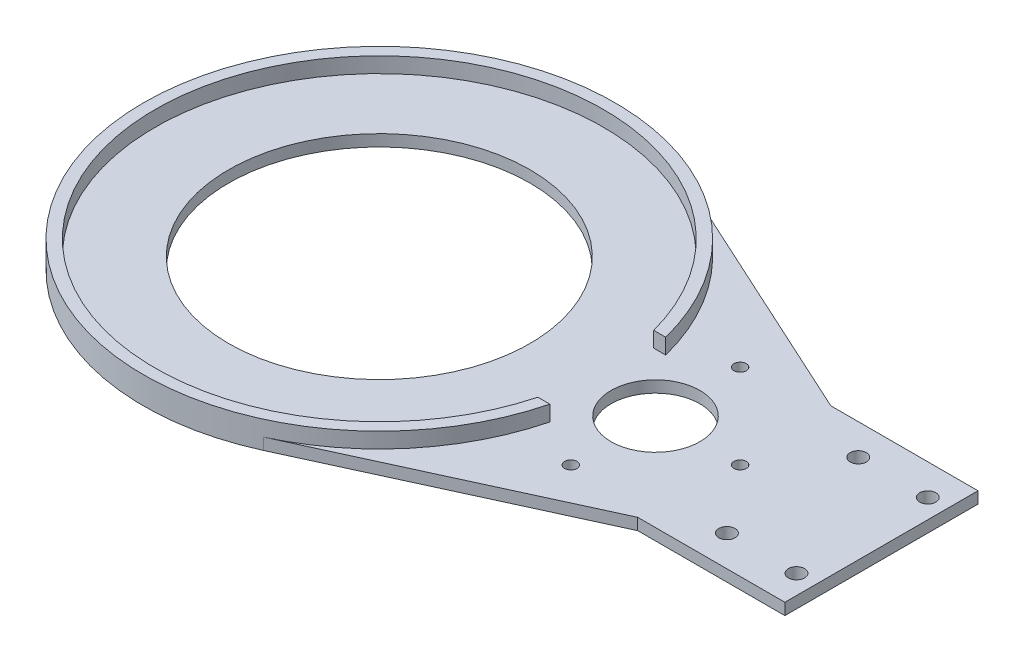
ISO-10303-21;
HEADER;
FILE_DESCRIPTION(('STEP AP214'),'2;1');
FILE_NAME('part.step','',(''),(''),'','','');
FILE_SCHEMA(('AUTOMOTIVE_DESIGN { 1 0 10303 214 1 1 1 1 }'));
ENDSEC;
DATA;
#1=APPLICATION_CONTEXT('core data for automotive mechanical design processes');
#2=APPLICATION_PROTOCOL_DEFINITION('international standard','automotive_design',2000,#1);
#3=PRODUCT_CONTEXT('',#1,'mechanical');
#4=PRODUCT('Part','Part','',(#3));
#5=PRODUCT_RELATED_PRODUCT_CATEGORY('part','',(#4));
#6=PRODUCT_DEFINITION_FORMATION('','',#4);
#7=PRODUCT_DEFINITION_CONTEXT('part definition',#1,'design');
#8=PRODUCT_DEFINITION('design','',#6,#7);
#9=PRODUCT_DEFINITION_SHAPE('','',#8);
#10=(LENGTH_UNIT() NAMED_UNIT(*) SI_UNIT(.MILLI.,.METRE.));
#11=(NAMED_UNIT(*) PLANE_ANGLE_UNIT() SI_UNIT($,.RADIAN.));
#12=(NAMED_UNIT(*) SI_UNIT($,.STERADIAN.) SOLID_ANGLE_UNIT());
#13=UNCERTAINTY_MEASURE_WITH_UNIT(LENGTH_MEASURE(1.E-05),#10,'distance_accuracy_value','');
#14=(GEOMETRIC_REPRESENTATION_CONTEXT(3) GLOBAL_UNCERTAINTY_ASSIGNED_CONTEXT((#13)) GLOBAL_UNIT_ASSIGNED_CONTEXT((#10,
#11,#12)) REPRESENTATION_CONTEXT('',''));
#15=CARTESIAN_POINT('',(0.,0.,0.));
#16=DIRECTION('',(0.,0.,1.));
#17=DIRECTION('',(1.,0.,0.));
#18=AXIS2_PLACEMENT_3D('',#15,#16,#17);
#19=CARTESIAN_POINT('',(91.9018888050589,3.,-25.));
#20=DIRECTION('',(0.,0.,1.));
#21=DIRECTION('',(1.,0.,0.));
#22=AXIS2_PLACEMENT_3D('',#19,#20,#21);
#23=PLANE('',#22);
#24=DIRECTION('',(-1.,0.,0.));
#25=VECTOR('',#24,1.);
#26=CARTESIAN_POINT('',(91.9018888050589,0.,-25.));
#27=LINE('',#26,#25);
#28=CARTESIAN_POINT('',(130.,0.,-25.));
#29=VERTEX_POINT('',#28);
#30=CARTESIAN_POINT('',(91.9018888050589,0.,-25.));
#31=VERTEX_POINT('',#30);
#32=EDGE_CURVE('E143',#29,#31,#27,.T.);
#33=ORIENTED_EDGE('',*,*,#32,.T.);
#34=DIRECTION('',(0.,-1.,0.));
#35=VECTOR('',#34,1.);
#36=CARTESIAN_POINT('',(91.9018888050589,3.,-25.));
#37=LINE('',#36,#35);
#38=CARTESIAN_POINT('',(91.9018888050589,3.,-25.));
#39=VERTEX_POINT('',#38);
#40=EDGE_CURVE('E172',#39,#31,#37,.T.);
#41=ORIENTED_EDGE('',*,*,#40,.F.);
#42=DIRECTION('',(-1.,0.,0.));
#43=VECTOR('',#42,1.);
#44=CARTESIAN_POINT('',(91.9018888050589,3.,-25.));
#45=LINE('',#44,#43);
#46=CARTESIAN_POINT('',(130.,3.,-25.));
#47=VERTEX_POINT('',#46);
#48=EDGE_CURVE('E161',#47,#39,#45,.T.);
#49=ORIENTED_EDGE('',*,*,#48,.F.);
#50=DIRECTION('',(0.,-1.,0.));
#51=VECTOR('',#50,1.);
#52=CARTESIAN_POINT('',(130.,3.,-25.));
#53=LINE('',#52,#51);
#54=EDGE_CURVE('E139',#47,#29,#53,.T.);
#55=ORIENTED_EDGE('',*,*,#54,.T.);
#56=EDGE_LOOP('',(#33,#41,#49,#55));
#57=FACE_BOUND('',#56,.T.);
#58=ADVANCED_FACE('F41',(#57),#23,.F.);
#59=CARTESIAN_POINT('',(91.9018888050589,3.,-25.));
#60=DIRECTION('',(-0.416742034836808,0.,0.909024794161345));
#61=DIRECTION('',(0.909024794161346,0.,0.416742034836809));
#62=AXIS2_PLACEMENT_3D('',#59,#60,#61);
#63=PLANE('',#62);
#64=DIRECTION('',(-0.909024794161346,0.,-0.416742034836809));
#65=VECTOR('',#64,1.);
#66=CARTESIAN_POINT('',(91.9018888050589,0.,-25.));
#67=LINE('',#66,#65);
#68=CARTESIAN_POINT('',(25.4316826759162,0.,-55.4732380636961));
#69=VERTEX_POINT('',#68);
#70=EDGE_CURVE('E147',#31,#69,#67,.T.);
#71=ORIENTED_EDGE('',*,*,#70,.T.);
#72=DIRECTION('',(0.,-1.,0.));
#73=VECTOR('',#72,1.);
#74=CARTESIAN_POINT('',(25.4316826759162,3.,-55.4732380636961));
#75=LINE('',#74,#73);
#76=CARTESIAN_POINT('',(25.4316826759162,3.,-55.4732380636961));
#77=VERTEX_POINT('',#76);
#78=EDGE_CURVE('E168',#77,#69,#75,.T.);
#79=ORIENTED_EDGE('',*,*,#78,.F.);
#80=DIRECTION('',(-0.909024794161346,0.,-0.416742034836809));
#81=VECTOR('',#80,1.);
#82=CARTESIAN_POINT('',(91.9018888050589,3.,-25.));
#83=LINE('',#82,#81);
#84=EDGE_CURVE('E101',#39,#77,#83,.T.);
#85=ORIENTED_EDGE('',*,*,#84,.F.);
#86=ORIENTED_EDGE('',*,*,#40,.T.);
#87=EDGE_LOOP('',(#71,#79,#85,#86));
#88=FACE_BOUND('',#87,.T.);
#89=ADVANCED_FACE('F313',(#88),#63,.F.);
#90=CARTESIAN_POINT('',(0.,3.,0.));
#91=DIRECTION('',(0.,-1.,0.));
#92=DIRECTION('',(0.,0.,-1.));
#93=AXIS2_PLACEMENT_3D('',#90,#91,#92);
#94=CYLINDRICAL_SURFACE('',#93,61.025);
#95=CARTESIAN_POINT('',(0.,7.,0.));
#96=DIRECTION('',(0.,1.,0.));
#97=DIRECTION('',(0.,0.,1.));
#98=AXIS2_PLACEMENT_3D('',#95,#96,#97);
#99=CIRCLE('',#98,61.025);
#100=CARTESIAN_POINT('',(59.1527736036105,7.,-15.));
#101=VERTEX_POINT('',#100);
#102=CARTESIAN_POINT('',(59.1527736036105,7.,15.));
#103=VERTEX_POINT('',#102);
#104=EDGE_CURVE('E232',#101,#103,#99,.T.);
#105=ORIENTED_EDGE('',*,*,#104,.F.);
#106=DIRECTION('',(0.,-1.,0.));
#107=VECTOR('',#106,1.);
#108=CARTESIAN_POINT('',(59.1527736036105,3.,-15.));
#109=LINE('',#108,#107);
#110=CARTESIAN_POINT('',(59.1527736036105,3.00000000000001,-15.));
#111=VERTEX_POINT('',#110);
#112=EDGE_CURVE('E188',#101,#111,#109,.T.);
#113=ORIENTED_EDGE('',*,*,#112,.T.);
#114=CARTESIAN_POINT('',(0.,3.,0.));
#115=DIRECTION('',(0.,1.,0.));
#116=DIRECTION('',(0.,0.,1.));
#117=AXIS2_PLACEMENT_3D('',#114,#115,#116);
#118=CIRCLE('',#117,61.025);
#119=EDGE_CURVE('E174',#111,#77,#118,.T.);
#120=ORIENTED_EDGE('',*,*,#119,.T.);
#121=ORIENTED_EDGE('',*,*,#78,.T.);
#122=CARTESIAN_POINT('',(0.,0.,0.));
#123=DIRECTION('',(0.,1.,0.));
#124=DIRECTION('',(0.,0.,1.));
#125=AXIS2_PLACEMENT_3D('',#122,#123,#124);
#126=CIRCLE('',#125,61.025);
#127=CARTESIAN_POINT('',(25.4316826759162,0.,55.4732380636961));
#128=VERTEX_POINT('',#127);
#129=EDGE_CURVE('E151',#69,#128,#126,.T.);
#130=ORIENTED_EDGE('',*,*,#129,.T.);
#131=DIRECTION('',(0.,-1.,0.));
#132=VECTOR('',#131,1.);
#133=CARTESIAN_POINT('',(25.4316826759162,3.,55.4732380636961));
#134=LINE('',#133,#132);
#135=CARTESIAN_POINT('',(25.4316826759162,3.,55.4732380636961));
#136=VERTEX_POINT('',#135);
#137=EDGE_CURVE('E132',#136,#128,#134,.T.);
#138=ORIENTED_EDGE('',*,*,#137,.F.);
#139=CARTESIAN_POINT('',(59.1527736036105,3.00000000000001,15.));
#140=VERTEX_POINT('',#139);
#141=EDGE_CURVE('E118',#136,#140,#118,.T.);
#142=ORIENTED_EDGE('',*,*,#141,.T.);
#143=DIRECTION('',(0.,-1.,0.));
#144=VECTOR('',#143,1.);
#145=CARTESIAN_POINT('',(59.1527736036105,3.,15.));
#146=LINE('',#145,#144);
#147=EDGE_CURVE('E200',#140,#103,#146,.F.);
#148=ORIENTED_EDGE('',*,*,#147,.T.);
#149=EDGE_LOOP('',(#105,#113,#120,#121,#130,#138,#142,#148));
#150=FACE_BOUND('',#149,.T.);
#151=ADVANCED_FACE('F315',(#150),#94,.T.);
#152=CARTESIAN_POINT('',(91.9018888050589,3.,25.));
#153=DIRECTION('',(-0.416742034836808,0.,-0.909024794161345));
#154=DIRECTION('',(-0.909024794161346,0.,0.416742034836809));
#155=AXIS2_PLACEMENT_3D('',#152,#153,#154);
#156=PLANE('',#155);
#157=DIRECTION('',(0.909024794161346,0.,-0.416742034836809));
#158=VECTOR('',#157,1.);
#159=CARTESIAN_POINT('',(91.9018888050589,0.,25.));
#160=LINE('',#159,#158);
#161=CARTESIAN_POINT('',(91.9018888050589,0.,25.));
#162=VERTEX_POINT('',#161);
#163=EDGE_CURVE('E128',#128,#162,#160,.T.);
#164=ORIENTED_EDGE('',*,*,#163,.T.);
#165=DIRECTION('',(0.,-1.,0.));
#166=VECTOR('',#165,1.);
#167=CARTESIAN_POINT('',(91.9018888050589,3.,25.));
#168=LINE('',#167,#166);
#169=CARTESIAN_POINT('',(91.9018888050589,3.,25.));
#170=VERTEX_POINT('',#169);
#171=EDGE_CURVE('E125',#170,#162,#168,.T.);
#172=ORIENTED_EDGE('',*,*,#171,.F.);
#173=DIRECTION('',(0.909024794161346,0.,-0.416742034836809));
#174=VECTOR('',#173,1.);
#175=CARTESIAN_POINT('',(91.9018888050589,3.,25.));
#176=LINE('',#175,#174);
#177=EDGE_CURVE('E109',#136,#170,#176,.T.);
#178=ORIENTED_EDGE('',*,*,#177,.F.);
#179=ORIENTED_EDGE('',*,*,#137,.T.);
#180=EDGE_LOOP('',(#164,#172,#178,#179));
#181=FACE_BOUND('',#180,.T.);
#182=ADVANCED_FACE('F126',(#181),#156,.F.);
#183=CARTESIAN_POINT('',(91.9018888050589,3.,25.));
#184=DIRECTION('',(0.,0.,-1.));
#185=DIRECTION('',(-1.,0.,0.));
#186=AXIS2_PLACEMENT_3D('',#183,#184,#185);
#187=PLANE('',#186);
#188=DIRECTION('',(1.,0.,0.));
#189=VECTOR('',#188,1.);
#190=CARTESIAN_POINT('',(91.9018888050589,0.,25.));
#191=LINE('',#190,#189);
#192=CARTESIAN_POINT('',(130.,0.,25.));
#193=VERTEX_POINT('',#192);
#194=EDGE_CURVE('E156',#162,#193,#191,.T.);
#195=ORIENTED_EDGE('',*,*,#194,.T.);
#196=DIRECTION('',(0.,-1.,0.));
#197=VECTOR('',#196,1.);
#198=CARTESIAN_POINT('',(130.,3.,25.));
#199=LINE('',#198,#197);
#200=CARTESIAN_POINT('',(130.,3.,25.));
#201=VERTEX_POINT('',#200);
#202=EDGE_CURVE('E133',#201,#193,#199,.T.);
#203=ORIENTED_EDGE('',*,*,#202,.F.);
#204=DIRECTION('',(1.,0.,0.));
#205=VECTOR('',#204,1.);
#206=CARTESIAN_POINT('',(91.9018888050589,3.,25.));
#207=LINE('',#206,#205);
#208=EDGE_CURVE('E115',#170,#201,#207,.T.);
#209=ORIENTED_EDGE('',*,*,#208,.F.);
#210=ORIENTED_EDGE('',*,*,#171,.T.);
#211=EDGE_LOOP('',(#195,#203,#209,#210));
#212=FACE_BOUND('',#211,.T.);
#213=ADVANCED_FACE('F135',(#212),#187,.F.);
#214=CARTESIAN_POINT('',(130.,3.,-25.));
#215=DIRECTION('',(-1.,0.,0.));
#216=DIRECTION('',(0.,0.,1.));
#217=AXIS2_PLACEMENT_3D('',#214,#215,#216);
#218=PLANE('',#217);
#219=DIRECTION('',(0.,0.,-1.));
#220=VECTOR('',#219,1.);
#221=CARTESIAN_POINT('',(130.,0.,-25.));
#222=LINE('',#221,#220);
#223=EDGE_CURVE('E92',#193,#29,#222,.T.);
#224=ORIENTED_EDGE('',*,*,#223,.T.);
#225=ORIENTED_EDGE('',*,*,#54,.F.);
#226=DIRECTION('',(0.,0.,-1.));
#227=VECTOR('',#226,1.);
#228=CARTESIAN_POINT('',(130.,3.,-25.));
#229=LINE('',#228,#227);
#230=EDGE_CURVE('E65',#201,#47,#229,.T.);
#231=ORIENTED_EDGE('',*,*,#230,.F.);
#232=ORIENTED_EDGE('',*,*,#202,.T.);
#233=EDGE_LOOP('',(#224,#225,#231,#232));
#234=FACE_BOUND('',#233,.T.);
#235=ADVANCED_FACE('F319',(#234),#218,.F.);
#236=CARTESIAN_POINT('',(0.,3.,0.));
#237=DIRECTION('',(0.,1.,0.));
#238=DIRECTION('',(0.,0.,1.));
#239=AXIS2_PLACEMENT_3D('',#236,#237,#238);
#240=PLANE('',#239);
#241=CARTESIAN_POINT('',(0.,3.,0.));
#242=DIRECTION('',(0.,1.,0.));
#243=DIRECTION('',(0.,0.,1.));
#244=AXIS2_PLACEMENT_3D('',#241,#242,#243);
#245=CIRCLE('',#244,58.025);
#246=CARTESIAN_POINT('',(56.0526593927532,3.,-15.));
#247=VERTEX_POINT('',#246);
#248=CARTESIAN_POINT('',(56.0526593927532,3.,15.));
#249=VERTEX_POINT('',#248);
#250=EDGE_CURVE('E187',#247,#249,#245,.T.);
#251=ORIENTED_EDGE('',*,*,#250,.T.);
#252=DIRECTION('',(1.,0.,0.));
#253=VECTOR('',#252,1.);
#254=CARTESIAN_POINT('',(51.025,3.00000000000001,15.));
#255=LINE('',#254,#253);
#256=EDGE_CURVE('E56',#249,#140,#255,.T.);
#257=ORIENTED_EDGE('',*,*,#256,.T.);
#258=ORIENTED_EDGE('',*,*,#141,.F.);
#259=ORIENTED_EDGE('',*,*,#177,.T.);
#260=ORIENTED_EDGE('',*,*,#208,.T.);
#261=ORIENTED_EDGE('',*,*,#230,.T.);
#262=ORIENTED_EDGE('',*,*,#48,.T.);
#263=ORIENTED_EDGE('',*,*,#84,.T.);
#264=ORIENTED_EDGE('',*,*,#119,.F.);
#265=DIRECTION('',(1.,0.,0.));
#266=VECTOR('',#265,1.);
#267=CARTESIAN_POINT('',(51.025,3.00000000000001,-15.));
#268=LINE('',#267,#266);
#269=EDGE_CURVE('E208',#247,#111,#268,.T.);
#270=ORIENTED_EDGE('',*,*,#269,.F.);
#271=EDGE_LOOP('',(#251,#257,#258,#259,#260,#261,#262,#263,#264,#270));
#272=FACE_BOUND('',#271,.T.);
#273=CARTESIAN_POINT('',(71.5,3.,0.));
#274=DIRECTION('',(0.,1.,0.));
#275=DIRECTION('',(0.,0.,1.));
#276=AXIS2_PLACEMENT_3D('',#273,#274,#275);
#277=CIRCLE('',#276,11.5);
#278=CARTESIAN_POINT('',(71.5,3.,11.5));
#279=VERTEX_POINT('',#278);
#280=EDGE_CURVE('E244',#279,#279,#277,.T.);
#281=ORIENTED_EDGE('',*,*,#280,.F.);
#282=EDGE_LOOP('',(#281));
#283=FACE_BOUND('',#282,.T.);
#284=CARTESIAN_POINT('',(71.5,3.,21.917));
#285=DIRECTION('',(0.,1.,0.));
#286=DIRECTION('',(0.,0.,-1.));
#287=AXIS2_PLACEMENT_3D('',#284,#285,#286);
#288=CIRCLE('',#287,1.6);
#289=CARTESIAN_POINT('',(71.5,3.,20.317));
#290=VERTEX_POINT('',#289);
#291=EDGE_CURVE('E243',#290,#290,#288,.T.);
#292=ORIENTED_EDGE('',*,*,#291,.F.);
#293=EDGE_LOOP('',(#292));
#294=FACE_BOUND('',#293,.T.);
#295=CARTESIAN_POINT('',(107.,3.,-17.));
#296=DIRECTION('',(0.,1.,0.));
#297=DIRECTION('',(0.,0.,1.));
#298=AXIS2_PLACEMENT_3D('',#295,#296,#297);
#299=CIRCLE('',#298,2.1);
#300=CARTESIAN_POINT('',(107.,3.,-14.9));
#301=VERTEX_POINT('',#300);
#302=EDGE_CURVE('E276',#301,#301,#299,.T.);
#303=ORIENTED_EDGE('',*,*,#302,.F.);
#304=EDGE_LOOP('',(#303));
#305=FACE_BOUND('',#304,.T.);
#306=CARTESIAN_POINT('',(93.417,3.,0.));
#307=DIRECTION('',(0.,1.,0.));
#308=DIRECTION('',(0.,0.,1.));
#309=AXIS2_PLACEMENT_3D('',#306,#307,#308);
#310=CIRCLE('',#309,1.60000000000001);
#311=CARTESIAN_POINT('',(93.417,3.,1.60000000000001));
#312=VERTEX_POINT('',#311);
#313=EDGE_CURVE('E275',#312,#312,#310,.T.);
#314=ORIENTED_EDGE('',*,*,#313,.F.);
#315=EDGE_LOOP('',(#314));
#316=FACE_BOUND('',#315,.T.);
#317=CARTESIAN_POINT('',(71.5,3.,-21.917));
#318=DIRECTION('',(0.,1.,0.));
#319=DIRECTION('',(0.,0.,1.));
#320=AXIS2_PLACEMENT_3D('',#317,#318,#319);
#321=CIRCLE('',#320,1.6);
#322=CARTESIAN_POINT('',(71.5,3.,-20.317));
#323=VERTEX_POINT('',#322);
#324=EDGE_CURVE('E292',#323,#323,#321,.T.);
#325=ORIENTED_EDGE('',*,*,#324,.F.);
#326=EDGE_LOOP('',(#325));
#327=FACE_BOUND('',#326,.T.);
#328=CARTESIAN_POINT('',(125.,3.,17.));
#329=DIRECTION('',(0.,1.,0.));
#330=DIRECTION('',(0.,0.,-1.));
#331=AXIS2_PLACEMENT_3D('',#328,#329,#330);
#332=CIRCLE('',#331,2.09999999999999);
#333=CARTESIAN_POINT('',(125.,3.,14.9));
#334=VERTEX_POINT('',#333);
#335=EDGE_CURVE('E260',#334,#334,#332,.T.);
#336=ORIENTED_EDGE('',*,*,#335,.F.);
#337=EDGE_LOOP('',(#336));
#338=FACE_BOUND('',#337,.T.);
#339=CARTESIAN_POINT('',(107.,3.,17.));
#340=DIRECTION('',(0.,1.,0.));
#341=DIRECTION('',(0.,0.,-1.));
#342=AXIS2_PLACEMENT_3D('',#339,#340,#341);
#343=CIRCLE('',#342,2.1);
#344=CARTESIAN_POINT('',(107.,3.,14.9));
#345=VERTEX_POINT('',#344);
#346=EDGE_CURVE('E236',#345,#345,#343,.T.);
#347=ORIENTED_EDGE('',*,*,#346,.F.);
#348=EDGE_LOOP('',(#347));
#349=FACE_BOUND('',#348,.T.);
#350=CARTESIAN_POINT('',(125.,3.,-17.));
#351=DIRECTION('',(0.,1.,0.));
#352=DIRECTION('',(0.,0.,1.));
#353=AXIS2_PLACEMENT_3D('',#350,#351,#352);
#354=CIRCLE('',#353,2.09999999999999);
#355=CARTESIAN_POINT('',(125.,3.,-14.9));
#356=VERTEX_POINT('',#355);
#357=EDGE_CURVE('E291',#356,#356,#354,.T.);
#358=ORIENTED_EDGE('',*,*,#357,.F.);
#359=EDGE_LOOP('',(#358));
#360=FACE_BOUND('',#359,.T.);
#361=CARTESIAN_POINT('',(0.,3.,0.));
#362=DIRECTION('',(0.,1.,0.));
#363=DIRECTION('',(0.,0.,1.));
#364=AXIS2_PLACEMENT_3D('',#361,#362,#363);
#365=CIRCLE('',#364,39.);
#366=CARTESIAN_POINT('',(0.,3.,39.));
#367=VERTEX_POINT('',#366);
#368=EDGE_CURVE('E252',#367,#367,#365,.T.);
#369=ORIENTED_EDGE('',*,*,#368,.F.);
#370=EDGE_LOOP('',(#369));
#371=FACE_BOUND('',#370,.T.);
#372=ADVANCED_FACE('F112',(#272,#283,#294,#305,#316,#327,#338,#349,#360,#371),#240,.T.);
#373=CARTESIAN_POINT('',(0.,0.,0.));
#374=DIRECTION('',(0.,1.,0.));
#375=DIRECTION('',(0.,0.,1.));
#376=AXIS2_PLACEMENT_3D('',#373,#374,#375);
#377=PLANE('',#376);
#378=CARTESIAN_POINT('',(71.5,0.,21.917));
#379=DIRECTION('',(0.,1.,0.));
#380=DIRECTION('',(0.,0.,-1.));
#381=AXIS2_PLACEMENT_3D('',#378,#379,#380);
#382=CIRCLE('',#381,1.6);
#383=CARTESIAN_POINT('',(71.5,0.,20.317));
#384=VERTEX_POINT('',#383);
#385=EDGE_CURVE('E280',#384,#384,#382,.T.);
#386=ORIENTED_EDGE('',*,*,#385,.T.);
#387=EDGE_LOOP('',(#386));
#388=FACE_BOUND('',#387,.T.);
#389=CARTESIAN_POINT('',(107.,0.,-17.));
#390=DIRECTION('',(0.,1.,0.));
#391=DIRECTION('',(0.,0.,1.));
#392=AXIS2_PLACEMENT_3D('',#389,#390,#391);
#393=CIRCLE('',#392,2.1);
#394=CARTESIAN_POINT('',(107.,0.,-14.9));
#395=VERTEX_POINT('',#394);
#396=EDGE_CURVE('E271',#395,#395,#393,.T.);
#397=ORIENTED_EDGE('',*,*,#396,.T.);
#398=EDGE_LOOP('',(#397));
#399=FACE_BOUND('',#398,.T.);
#400=CARTESIAN_POINT('',(93.417,0.,0.));
#401=DIRECTION('',(0.,1.,0.));
#402=DIRECTION('',(0.,0.,1.));
#403=AXIS2_PLACEMENT_3D('',#400,#401,#402);
#404=CIRCLE('',#403,1.60000000000001);
#405=CARTESIAN_POINT('',(93.417,0.,1.60000000000001));
#406=VERTEX_POINT('',#405);
#407=EDGE_CURVE('E296',#406,#406,#404,.T.);
#408=ORIENTED_EDGE('',*,*,#407,.T.);
#409=EDGE_LOOP('',(#408));
#410=FACE_BOUND('',#409,.T.);
#411=CARTESIAN_POINT('',(71.5,0.,-21.917));
#412=DIRECTION('',(0.,1.,0.));
#413=DIRECTION('',(0.,0.,1.));
#414=AXIS2_PLACEMENT_3D('',#411,#412,#413);
#415=CIRCLE('',#414,1.6);
#416=CARTESIAN_POINT('',(71.5,0.,-20.317));
#417=VERTEX_POINT('',#416);
#418=EDGE_CURVE('E287',#417,#417,#415,.T.);
#419=ORIENTED_EDGE('',*,*,#418,.T.);
#420=EDGE_LOOP('',(#419));
#421=FACE_BOUND('',#420,.T.);
#422=CARTESIAN_POINT('',(71.5,0.,0.));
#423=DIRECTION('',(0.,1.,0.));
#424=DIRECTION('',(0.,0.,1.));
#425=AXIS2_PLACEMENT_3D('',#422,#423,#424);
#426=CIRCLE('',#425,11.5);
#427=CARTESIAN_POINT('',(71.5,0.,11.5));
#428=VERTEX_POINT('',#427);
#429=EDGE_CURVE('E239',#428,#428,#426,.T.);
#430=ORIENTED_EDGE('',*,*,#429,.T.);
#431=EDGE_LOOP('',(#430));
#432=FACE_BOUND('',#431,.T.);
#433=CARTESIAN_POINT('',(0.,0.,0.));
#434=DIRECTION('',(0.,1.,0.));
#435=DIRECTION('',(0.,0.,1.));
#436=AXIS2_PLACEMENT_3D('',#433,#434,#435);
#437=CIRCLE('',#436,39.);
#438=CARTESIAN_POINT('',(0.,0.,39.));
#439=VERTEX_POINT('',#438);
#440=EDGE_CURVE('E248',#439,#439,#437,.T.);
#441=ORIENTED_EDGE('',*,*,#440,.T.);
#442=EDGE_LOOP('',(#441));
#443=FACE_BOUND('',#442,.T.);
#444=CARTESIAN_POINT('',(125.,0.,17.));
#445=DIRECTION('',(0.,1.,0.));
#446=DIRECTION('',(0.,0.,-1.));
#447=AXIS2_PLACEMENT_3D('',#444,#445,#446);
#448=CIRCLE('',#447,2.09999999999999);
#449=CARTESIAN_POINT('',(125.,0.,14.9));
#450=VERTEX_POINT('',#449);
#451=EDGE_CURVE('E256',#450,#450,#448,.T.);
#452=ORIENTED_EDGE('',*,*,#451,.T.);
#453=EDGE_LOOP('',(#452));
#454=FACE_BOUND('',#453,.T.);
#455=CARTESIAN_POINT('',(107.,0.,17.));
#456=DIRECTION('',(0.,1.,0.));
#457=DIRECTION('',(0.,0.,-1.));
#458=AXIS2_PLACEMENT_3D('',#455,#456,#457);
#459=CIRCLE('',#458,2.1);
#460=CARTESIAN_POINT('',(107.,0.,14.9));
#461=VERTEX_POINT('',#460);
#462=EDGE_CURVE('E264',#461,#461,#459,.T.);
#463=ORIENTED_EDGE('',*,*,#462,.T.);
#464=EDGE_LOOP('',(#463));
#465=FACE_BOUND('',#464,.T.);
#466=CARTESIAN_POINT('',(125.,0.,-17.));
#467=DIRECTION('',(0.,1.,0.));
#468=DIRECTION('',(0.,0.,1.));
#469=AXIS2_PLACEMENT_3D('',#466,#467,#468);
#470=CIRCLE('',#469,2.09999999999999);
#471=CARTESIAN_POINT('',(125.,0.,-14.9));
#472=VERTEX_POINT('',#471);
#473=EDGE_CURVE('E148',#472,#472,#470,.T.);
#474=ORIENTED_EDGE('',*,*,#473,.T.);
#475=EDGE_LOOP('',(#474));
#476=FACE_BOUND('',#475,.T.);
#477=ORIENTED_EDGE('',*,*,#32,.F.);
#478=ORIENTED_EDGE('',*,*,#223,.F.);
#479=ORIENTED_EDGE('',*,*,#194,.F.);
#480=ORIENTED_EDGE('',*,*,#163,.F.);
#481=ORIENTED_EDGE('',*,*,#129,.F.);
#482=ORIENTED_EDGE('',*,*,#70,.F.);
#483=EDGE_LOOP('',(#477,#478,#479,#480,#481,#482));
#484=FACE_BOUND('',#483,.T.);
#485=ADVANCED_FACE('F318',(#388,#399,#410,#421,#432,#443,#454,#465,#476,#484),#377,.F.);
#486=CARTESIAN_POINT('',(125.,0.,-17.));
#487=DIRECTION('',(0.,1.,0.));
#488=DIRECTION('',(0.,0.,1.));
#489=AXIS2_PLACEMENT_3D('',#486,#487,#488);
#490=CYLINDRICAL_SURFACE('',#489,2.09999999999999);
#491=ORIENTED_EDGE('',*,*,#473,.F.);
#492=EDGE_LOOP('',(#491));
#493=FACE_BOUND('',#492,.T.);
#494=ORIENTED_EDGE('',*,*,#357,.T.);
#495=EDGE_LOOP('',(#494));
#496=FACE_BOUND('',#495,.T.);
#497=ADVANCED_FACE('F338',(#493,#496),#490,.F.);
#498=CARTESIAN_POINT('',(107.,0.,17.));
#499=DIRECTION('',(0.,1.,0.));
#500=DIRECTION('',(0.,0.,1.));
#501=AXIS2_PLACEMENT_3D('',#498,#499,#500);
#502=CYLINDRICAL_SURFACE('',#501,2.1);
#503=ORIENTED_EDGE('',*,*,#462,.F.);
#504=EDGE_LOOP('',(#503));
#505=FACE_BOUND('',#504,.T.);
#506=ORIENTED_EDGE('',*,*,#346,.T.);
#507=EDGE_LOOP('',(#506));
#508=FACE_BOUND('',#507,.T.);
#509=ADVANCED_FACE('F344',(#505,#508),#502,.F.);
#510=CARTESIAN_POINT('',(125.,0.,17.));
#511=DIRECTION('',(0.,1.,0.));
#512=DIRECTION('',(0.,0.,1.));
#513=AXIS2_PLACEMENT_3D('',#510,#511,#512);
#514=CYLINDRICAL_SURFACE('',#513,2.09999999999999);
#515=ORIENTED_EDGE('',*,*,#451,.F.);
#516=EDGE_LOOP('',(#515));
#517=FACE_BOUND('',#516,.T.);
#518=ORIENTED_EDGE('',*,*,#335,.T.);
#519=EDGE_LOOP('',(#518));
#520=FACE_BOUND('',#519,.T.);
#521=ADVANCED_FACE('F366',(#517,#520),#514,.F.);
#522=CARTESIAN_POINT('',(0.,0.,0.));
#523=DIRECTION('',(0.,1.,0.));
#524=DIRECTION('',(0.,0.,1.));
#525=AXIS2_PLACEMENT_3D('',#522,#523,#524);
#526=CYLINDRICAL_SURFACE('',#525,39.);
#527=ORIENTED_EDGE('',*,*,#440,.F.);
#528=EDGE_LOOP('',(#527));
#529=FACE_BOUND('',#528,.T.);
#530=ORIENTED_EDGE('',*,*,#368,.T.);
#531=EDGE_LOOP('',(#530));
#532=FACE_BOUND('',#531,.T.);
#533=ADVANCED_FACE('F370',(#529,#532),#526,.F.);
#534=CARTESIAN_POINT('',(71.5,0.,0.));
#535=DIRECTION('',(0.,1.,0.));
#536=DIRECTION('',(0.,0.,1.));
#537=AXIS2_PLACEMENT_3D('',#534,#535,#536);
#538=CYLINDRICAL_SURFACE('',#537,11.5);
#539=ORIENTED_EDGE('',*,*,#429,.F.);
#540=EDGE_LOOP('',(#539));
#541=FACE_BOUND('',#540,.T.);
#542=ORIENTED_EDGE('',*,*,#280,.T.);
#543=EDGE_LOOP('',(#542));
#544=FACE_BOUND('',#543,.T.);
#545=ADVANCED_FACE('F354',(#541,#544),#538,.F.);
#546=CARTESIAN_POINT('',(71.5,0.,-21.917));
#547=DIRECTION('',(0.,1.,0.));
#548=DIRECTION('',(0.,0.,1.));
#549=AXIS2_PLACEMENT_3D('',#546,#547,#548);
#550=CYLINDRICAL_SURFACE('',#549,1.6);
#551=ORIENTED_EDGE('',*,*,#418,.F.);
#552=EDGE_LOOP('',(#551));
#553=FACE_BOUND('',#552,.T.);
#554=ORIENTED_EDGE('',*,*,#324,.T.);
#555=EDGE_LOOP('',(#554));
#556=FACE_BOUND('',#555,.T.);
#557=ADVANCED_FACE('F350',(#553,#556),#550,.F.);
#558=CARTESIAN_POINT('',(93.417,0.,0.));
#559=DIRECTION('',(0.,1.,0.));
#560=DIRECTION('',(0.,0.,1.));
#561=AXIS2_PLACEMENT_3D('',#558,#559,#560);
#562=CYLINDRICAL_SURFACE('',#561,1.60000000000001);
#563=ORIENTED_EDGE('',*,*,#407,.F.);
#564=EDGE_LOOP('',(#563));
#565=FACE_BOUND('',#564,.T.);
#566=ORIENTED_EDGE('',*,*,#313,.T.);
#567=EDGE_LOOP('',(#566));
#568=FACE_BOUND('',#567,.T.);
#569=ADVANCED_FACE('F346',(#565,#568),#562,.F.);
#570=CARTESIAN_POINT('',(107.,0.,-17.));
#571=DIRECTION('',(0.,1.,0.));
#572=DIRECTION('',(0.,0.,1.));
#573=AXIS2_PLACEMENT_3D('',#570,#571,#572);
#574=CYLINDRICAL_SURFACE('',#573,2.1);
#575=ORIENTED_EDGE('',*,*,#396,.F.);
#576=EDGE_LOOP('',(#575));
#577=FACE_BOUND('',#576,.T.);
#578=ORIENTED_EDGE('',*,*,#302,.T.);
#579=EDGE_LOOP('',(#578));
#580=FACE_BOUND('',#579,.T.);
#581=ADVANCED_FACE('F349',(#577,#580),#574,.F.);
#582=CARTESIAN_POINT('',(71.5,0.,21.917));
#583=DIRECTION('',(0.,1.,0.));
#584=DIRECTION('',(0.,0.,1.));
#585=AXIS2_PLACEMENT_3D('',#582,#583,#584);
#586=CYLINDRICAL_SURFACE('',#585,1.6);
#587=ORIENTED_EDGE('',*,*,#385,.F.);
#588=EDGE_LOOP('',(#587));
#589=FACE_BOUND('',#588,.T.);
#590=ORIENTED_EDGE('',*,*,#291,.T.);
#591=EDGE_LOOP('',(#590));
#592=FACE_BOUND('',#591,.T.);
#593=ADVANCED_FACE('F356',(#589,#592),#586,.F.);
#594=CARTESIAN_POINT('',(-61.025,7.,0.));
#595=DIRECTION('',(0.,1.,0.));
#596=DIRECTION('',(0.,0.,1.));
#597=AXIS2_PLACEMENT_3D('',#594,#595,#596);
#598=PLANE('',#597);
#599=DIRECTION('',(-1.,0.,0.));
#600=VECTOR('',#599,1.);
#601=CARTESIAN_POINT('',(-61.025,7.,-15.));
#602=LINE('',#601,#600);
#603=CARTESIAN_POINT('',(56.0526593927532,7.,-15.));
#604=VERTEX_POINT('',#603);
#605=EDGE_CURVE('E194',#101,#604,#602,.T.);
#606=ORIENTED_EDGE('',*,*,#605,.F.);
#607=ORIENTED_EDGE('',*,*,#104,.T.);
#608=DIRECTION('',(1.,0.,0.));
#609=VECTOR('',#608,1.);
#610=CARTESIAN_POINT('',(-61.025,7.,15.));
#611=LINE('',#610,#609);
#612=CARTESIAN_POINT('',(56.0526593927532,7.,15.));
#613=VERTEX_POINT('',#612);
#614=EDGE_CURVE('E205',#613,#103,#611,.T.);
#615=ORIENTED_EDGE('',*,*,#614,.F.);
#616=CARTESIAN_POINT('',(0.,7.,0.));
#617=DIRECTION('',(0.,1.,0.));
#618=DIRECTION('',(0.,0.,1.));
#619=AXIS2_PLACEMENT_3D('',#616,#617,#618);
#620=CIRCLE('',#619,58.025);
#621=EDGE_CURVE('E193',#604,#613,#620,.T.);
#622=ORIENTED_EDGE('',*,*,#621,.F.);
#623=EDGE_LOOP('',(#606,#607,#615,#622));
#624=FACE_BOUND('',#623,.T.);
#625=ADVANCED_FACE('F359',(#624),#598,.T.);
#626=CARTESIAN_POINT('',(0.,38.1765170082958,0.));
#627=DIRECTION('',(0.,1.,0.));
#628=DIRECTION('',(0.,0.,1.));
#629=AXIS2_PLACEMENT_3D('',#626,#627,#628);
#630=CYLINDRICAL_SURFACE('',#629,58.025);
#631=DIRECTION('',(0.,1.,0.));
#632=VECTOR('',#631,1.);
#633=CARTESIAN_POINT('',(56.0526593927532,38.1765170082958,-15.));
#634=LINE('',#633,#632);
#635=EDGE_CURVE('E11',#604,#247,#634,.F.);
#636=ORIENTED_EDGE('',*,*,#635,.F.);
#637=ORIENTED_EDGE('',*,*,#621,.T.);
#638=DIRECTION('',(0.,1.,0.));
#639=VECTOR('',#638,1.);
#640=CARTESIAN_POINT('',(56.0526593927532,38.1765170082958,15.));
#641=LINE('',#640,#639);
#642=EDGE_CURVE('E49',#249,#613,#641,.T.);
#643=ORIENTED_EDGE('',*,*,#642,.F.);
#644=ORIENTED_EDGE('',*,*,#250,.F.);
#645=EDGE_LOOP('',(#636,#637,#643,#644));
#646=FACE_BOUND('',#645,.T.);
#647=ADVANCED_FACE('F226',(#646),#630,.F.);
#648=CARTESIAN_POINT('',(51.025,3.00000000000001,-15.));
#649=DIRECTION('',(0.,0.,-1.));
#650=DIRECTION('',(-1.,0.,0.));
#651=AXIS2_PLACEMENT_3D('',#648,#649,#650);
#652=PLANE('',#651);
#653=ORIENTED_EDGE('',*,*,#605,.T.);
#654=ORIENTED_EDGE('',*,*,#635,.T.);
#655=ORIENTED_EDGE('',*,*,#269,.T.);
#656=ORIENTED_EDGE('',*,*,#112,.F.);
#657=EDGE_LOOP('',(#653,#654,#655,#656));
#658=FACE_BOUND('',#657,.T.);
#659=ADVANCED_FACE('F215',(#658),#652,.F.);
#660=CARTESIAN_POINT('',(51.025,3.00000000000001,15.));
#661=DIRECTION('',(0.,0.,1.));
#662=DIRECTION('',(1.,0.,0.));
#663=AXIS2_PLACEMENT_3D('',#660,#661,#662);
#664=PLANE('',#663);
#665=ORIENTED_EDGE('',*,*,#256,.F.);
#666=ORIENTED_EDGE('',*,*,#642,.T.);
#667=ORIENTED_EDGE('',*,*,#614,.T.);
#668=ORIENTED_EDGE('',*,*,#147,.F.);
#669=EDGE_LOOP('',(#665,#666,#667,#668));
#670=FACE_BOUND('',#669,.T.);
#671=ADVANCED_FACE('F384',(#670),#664,.F.);
#672=CLOSED_SHELL('',(#58,#89,#151,#182,#213,#235,#372,#485,#497,#509,#521,#533,#545,#557,#569,
#581,#593,#625,#647,#659,#671));
#673=MANIFOLD_SOLID_BREP('B2',#672);
#674=ADVANCED_BREP_SHAPE_REPRESENTATION('',(#18,#673),#14);
#675=SHAPE_DEFINITION_REPRESENTATION(#9,#674);
ENDSEC;
END-ISO-10303-21;
